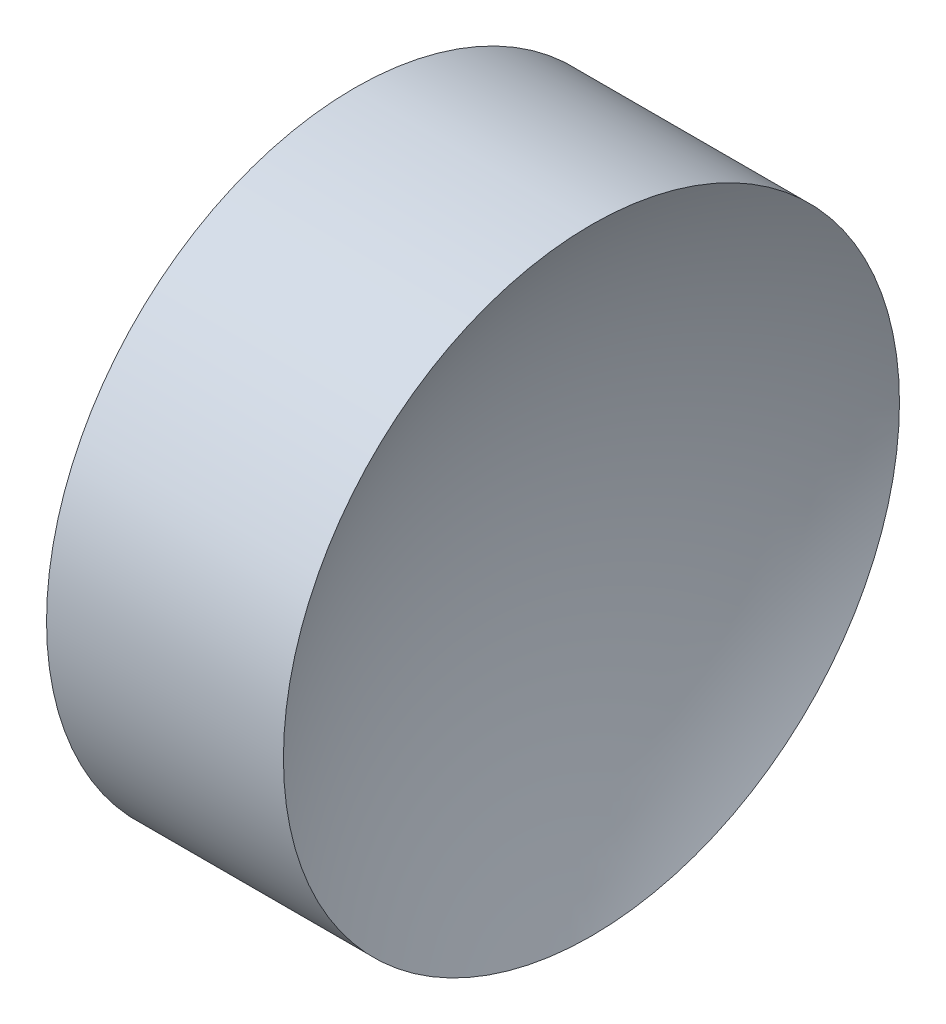
ISO-10303-21;
HEADER;
FILE_DESCRIPTION(('STEP AP214'),'2;1');
FILE_NAME('part.step','',(''),(''),'','','');
FILE_SCHEMA(('AUTOMOTIVE_DESIGN { 1 0 10303 214 1 1 1 1 }'));
ENDSEC;
DATA;
#1=APPLICATION_CONTEXT('core data for automotive mechanical design processes');
#2=APPLICATION_PROTOCOL_DEFINITION('international standard','automotive_design',2000,#1);
#3=PRODUCT_CONTEXT('',#1,'mechanical');
#4=PRODUCT('Part','Part','',(#3));
#5=PRODUCT_RELATED_PRODUCT_CATEGORY('part','',(#4));
#6=PRODUCT_DEFINITION_FORMATION('','',#4);
#7=PRODUCT_DEFINITION_CONTEXT('part definition',#1,'design');
#8=PRODUCT_DEFINITION('design','',#6,#7);
#9=PRODUCT_DEFINITION_SHAPE('','',#8);
#10=(LENGTH_UNIT() NAMED_UNIT(*) SI_UNIT(.MILLI.,.METRE.));
#11=(NAMED_UNIT(*) PLANE_ANGLE_UNIT() SI_UNIT($,.RADIAN.));
#12=(NAMED_UNIT(*) SI_UNIT($,.STERADIAN.) SOLID_ANGLE_UNIT());
#13=UNCERTAINTY_MEASURE_WITH_UNIT(LENGTH_MEASURE(1.E-05),#10,'distance_accuracy_value','');
#14=(GEOMETRIC_REPRESENTATION_CONTEXT(3) GLOBAL_UNCERTAINTY_ASSIGNED_CONTEXT((#13)) GLOBAL_UNIT_ASSIGNED_CONTEXT((#10,
#11,#12)) REPRESENTATION_CONTEXT('',''));
#15=CARTESIAN_POINT('',(0.,0.,0.));
#16=DIRECTION('',(0.,0.,1.));
#17=DIRECTION('',(1.,0.,0.));
#18=AXIS2_PLACEMENT_3D('',#15,#16,#17);
#19=CARTESIAN_POINT('',(73.4915998179847,32.6113014364937,0.));
#20=DIRECTION('',(-1.,0.,0.));
#21=DIRECTION('',(0.,-1.,0.));
#22=AXIS2_PLACEMENT_3D('',#19,#20,#21);
#23=SPHERICAL_SURFACE('',#22,12.64);
#24=CARTESIAN_POINT('',(62.5049215210653,32.6113014364937,0.));
#25=DIRECTION('',(-1.,0.,0.));
#26=DIRECTION('',(0.,0.,1.));
#27=AXIS2_PLACEMENT_3D('',#24,#25,#26);
#28=CIRCLE('',#27,6.25);
#29=CARTESIAN_POINT('',(62.5049215210653,32.6113014364937,6.25));
#30=VERTEX_POINT('',#29);
#31=EDGE_CURVE('E10',#30,#30,#28,.T.);
#32=ORIENTED_EDGE('',*,*,#31,.F.);
#33=EDGE_LOOP('',(#32));
#34=FACE_BOUND('',#33,.T.);
#35=ADVANCED_FACE('F35',(#34),#23,.F.);
#36=CARTESIAN_POINT('',(53.062326392671,32.6113014364937,0.));
#37=DIRECTION('',(-1.,0.,0.));
#38=DIRECTION('',(0.,0.,1.));
#39=AXIS2_PLACEMENT_3D('',#36,#37,#38);
#40=CYLINDRICAL_SURFACE('',#39,6.25);
#41=CARTESIAN_POINT('',(57.6982781062463,32.6113014364937,0.));
#42=DIRECTION('',(-1.,0.,0.));
#43=DIRECTION('',(0.,0.,1.));
#44=AXIS2_PLACEMENT_3D('',#41,#42,#43);
#45=CIRCLE('',#44,6.25);
#46=CARTESIAN_POINT('',(57.6982781062463,32.6113014364937,6.25));
#47=VERTEX_POINT('',#46);
#48=EDGE_CURVE('E41',#47,#47,#45,.T.);
#49=ORIENTED_EDGE('',*,*,#48,.F.);
#50=EDGE_LOOP('',(#49));
#51=FACE_BOUND('',#50,.T.);
#52=ORIENTED_EDGE('',*,*,#31,.T.);
#53=EDGE_LOOP('',(#52));
#54=FACE_BOUND('',#53,.T.);
#55=ADVANCED_FACE('F49',(#51,#54),#40,.T.);
#56=CARTESIAN_POINT('',(46.7115998093268,32.6113014364937,0.));
#57=DIRECTION('',(-1.,0.,0.));
#58=DIRECTION('',(0.,1.,0.));
#59=AXIS2_PLACEMENT_3D('',#56,#57,#58);
#60=SPHERICAL_SURFACE('',#59,12.64);
#61=ORIENTED_EDGE('',*,*,#48,.T.);
#62=EDGE_LOOP('',(#61));
#63=FACE_BOUND('',#62,.T.);
#64=ADVANCED_FACE('F47',(#63),#60,.F.);
#65=CLOSED_SHELL('',(#35,#55,#64));
#66=MANIFOLD_SOLID_BREP('B2',#65);
#67=ADVANCED_BREP_SHAPE_REPRESENTATION('',(#18,#66),#14);
#68=SHAPE_DEFINITION_REPRESENTATION(#9,#67);
ENDSEC;
END-ISO-10303-21;
